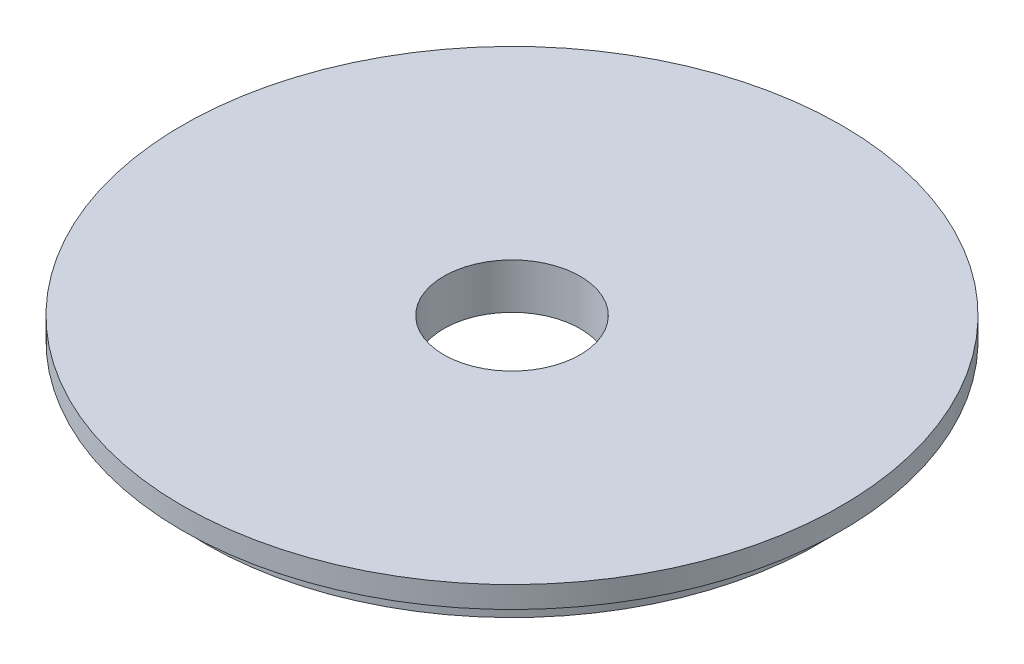
ISO-10303-21;
HEADER;
FILE_DESCRIPTION(('STEP AP214'),'2;1');
FILE_NAME('part.step','',(''),(''),'','','');
FILE_SCHEMA(('AUTOMOTIVE_DESIGN { 1 0 10303 214 1 1 1 1 }'));
ENDSEC;
DATA;
#1=APPLICATION_CONTEXT('core data for automotive mechanical design processes');
#2=APPLICATION_PROTOCOL_DEFINITION('international standard','automotive_design',2000,#1);
#3=PRODUCT_CONTEXT('',#1,'mechanical');
#4=PRODUCT('Part','Part','',(#3));
#5=PRODUCT_RELATED_PRODUCT_CATEGORY('part','',(#4));
#6=PRODUCT_DEFINITION_FORMATION('','',#4);
#7=PRODUCT_DEFINITION_CONTEXT('part definition',#1,'design');
#8=PRODUCT_DEFINITION('design','',#6,#7);
#9=PRODUCT_DEFINITION_SHAPE('','',#8);
#10=(LENGTH_UNIT() NAMED_UNIT(*) SI_UNIT(.MILLI.,.METRE.));
#11=(NAMED_UNIT(*) PLANE_ANGLE_UNIT() SI_UNIT($,.RADIAN.));
#12=(NAMED_UNIT(*) SI_UNIT($,.STERADIAN.) SOLID_ANGLE_UNIT());
#13=UNCERTAINTY_MEASURE_WITH_UNIT(LENGTH_MEASURE(1.E-05),#10,'distance_accuracy_value','');
#14=(GEOMETRIC_REPRESENTATION_CONTEXT(3) GLOBAL_UNCERTAINTY_ASSIGNED_CONTEXT((#13)) GLOBAL_UNIT_ASSIGNED_CONTEXT((#10,
#11,#12)) REPRESENTATION_CONTEXT('',''));
#15=CARTESIAN_POINT('',(0.,0.,0.));
#16=DIRECTION('',(0.,0.,1.));
#17=DIRECTION('',(1.,0.,0.));
#18=AXIS2_PLACEMENT_3D('',#15,#16,#17);
#19=CARTESIAN_POINT('',(0.,0.,0.));
#20=DIRECTION('',(0.,1.,0.));
#21=DIRECTION('',(0.,0.,1.));
#22=AXIS2_PLACEMENT_3D('',#19,#20,#21);
#23=CYLINDRICAL_SURFACE('',#22,9.525);
#24=CARTESIAN_POINT('',(0.,0.,0.));
#25=DIRECTION('',(0.,1.,0.));
#26=DIRECTION('',(0.,0.,1.));
#27=AXIS2_PLACEMENT_3D('',#24,#25,#26);
#28=CIRCLE('',#27,9.525);
#29=CARTESIAN_POINT('',(0.,0.,9.525));
#30=VERTEX_POINT('',#29);
#31=EDGE_CURVE('E10',#30,#30,#28,.T.);
#32=ORIENTED_EDGE('',*,*,#31,.T.);
#33=EDGE_LOOP('',(#32));
#34=FACE_BOUND('',#33,.T.);
#35=CARTESIAN_POINT('',(0.,-6.35,0.));
#36=DIRECTION('',(0.,1.,0.));
#37=DIRECTION('',(0.,0.,1.));
#38=AXIS2_PLACEMENT_3D('',#35,#36,#37);
#39=CIRCLE('',#38,9.525);
#40=CARTESIAN_POINT('',(0.,-6.35,9.525));
#41=VERTEX_POINT('',#40);
#42=EDGE_CURVE('E54',#41,#41,#39,.T.);
#43=ORIENTED_EDGE('',*,*,#42,.F.);
#44=EDGE_LOOP('',(#43));
#45=FACE_BOUND('',#44,.T.);
#46=ADVANCED_FACE('F32',(#34,#45),#23,.F.);
#47=CARTESIAN_POINT('',(-9.525,0.,0.));
#48=DIRECTION('',(0.,1.,0.));
#49=DIRECTION('',(0.,0.,1.));
#50=AXIS2_PLACEMENT_3D('',#47,#48,#49);
#51=PLANE('',#50);
#52=CARTESIAN_POINT('',(0.,0.,0.));
#53=DIRECTION('',(0.,1.,0.));
#54=DIRECTION('',(0.,0.,1.));
#55=AXIS2_PLACEMENT_3D('',#52,#53,#54);
#56=CIRCLE('',#55,46.0756);
#57=CARTESIAN_POINT('',(0.,0.,46.0756));
#58=VERTEX_POINT('',#57);
#59=EDGE_CURVE('E38',#58,#58,#56,.T.);
#60=ORIENTED_EDGE('',*,*,#59,.T.);
#61=EDGE_LOOP('',(#60));
#62=FACE_BOUND('',#61,.T.);
#63=ORIENTED_EDGE('',*,*,#31,.F.);
#64=EDGE_LOOP('',(#63));
#65=FACE_BOUND('',#64,.T.);
#66=ADVANCED_FACE('F62',(#62,#65),#51,.T.);
#67=CARTESIAN_POINT('',(0.,0.,0.));
#68=DIRECTION('',(0.,1.,0.));
#69=DIRECTION('',(0.,0.,1.));
#70=AXIS2_PLACEMENT_3D('',#67,#68,#69);
#71=CYLINDRICAL_SURFACE('',#70,46.0756);
#72=CARTESIAN_POINT('',(0.,-3.0226,0.));
#73=DIRECTION('',(0.,1.,0.));
#74=DIRECTION('',(0.,0.,1.));
#75=AXIS2_PLACEMENT_3D('',#72,#73,#74);
#76=CIRCLE('',#75,46.0756);
#77=CARTESIAN_POINT('',(0.,-3.0226,46.0756));
#78=VERTEX_POINT('',#77);
#79=EDGE_CURVE('E42',#78,#78,#76,.T.);
#80=ORIENTED_EDGE('',*,*,#79,.T.);
#81=EDGE_LOOP('',(#80));
#82=FACE_BOUND('',#81,.T.);
#83=ORIENTED_EDGE('',*,*,#59,.F.);
#84=EDGE_LOOP('',(#83));
#85=FACE_BOUND('',#84,.T.);
#86=ADVANCED_FACE('F66',(#82,#85),#71,.T.);
#87=CARTESIAN_POINT('',(-46.0756,-3.0226,0.));
#88=DIRECTION('',(0.,-1.,0.));
#89=DIRECTION('',(0.,0.,-1.));
#90=AXIS2_PLACEMENT_3D('',#87,#88,#89);
#91=PLANE('',#90);
#92=CARTESIAN_POINT('',(0.,-3.0226,0.));
#93=DIRECTION('',(0.,1.,0.));
#94=DIRECTION('',(0.,0.,1.));
#95=AXIS2_PLACEMENT_3D('',#92,#93,#94);
#96=CIRCLE('',#95,42.7482);
#97=CARTESIAN_POINT('',(0.,-3.0226,42.7482));
#98=VERTEX_POINT('',#97);
#99=EDGE_CURVE('E46',#98,#98,#96,.T.);
#100=ORIENTED_EDGE('',*,*,#99,.T.);
#101=EDGE_LOOP('',(#100));
#102=FACE_BOUND('',#101,.T.);
#103=ORIENTED_EDGE('',*,*,#79,.F.);
#104=EDGE_LOOP('',(#103));
#105=FACE_BOUND('',#104,.T.);
#106=ADVANCED_FACE('F70',(#102,#105),#91,.T.);
#107=CARTESIAN_POINT('',(0.,0.,0.));
#108=DIRECTION('',(0.,1.,0.));
#109=DIRECTION('',(0.,0.,1.));
#110=AXIS2_PLACEMENT_3D('',#107,#108,#109);
#111=CYLINDRICAL_SURFACE('',#110,42.7482);
#112=CARTESIAN_POINT('',(0.,-6.35,0.));
#113=DIRECTION('',(0.,1.,0.));
#114=DIRECTION('',(0.,0.,1.));
#115=AXIS2_PLACEMENT_3D('',#112,#113,#114);
#116=CIRCLE('',#115,42.7482);
#117=CARTESIAN_POINT('',(0.,-6.35,42.7482));
#118=VERTEX_POINT('',#117);
#119=EDGE_CURVE('E51',#118,#118,#116,.T.);
#120=ORIENTED_EDGE('',*,*,#119,.T.);
#121=EDGE_LOOP('',(#120));
#122=FACE_BOUND('',#121,.T.);
#123=ORIENTED_EDGE('',*,*,#99,.F.);
#124=EDGE_LOOP('',(#123));
#125=FACE_BOUND('',#124,.T.);
#126=ADVANCED_FACE('F77',(#122,#125),#111,.T.);
#127=CARTESIAN_POINT('',(-42.7482,-6.35,0.));
#128=DIRECTION('',(0.,-1.,0.));
#129=DIRECTION('',(0.,0.,-1.));
#130=AXIS2_PLACEMENT_3D('',#127,#128,#129);
#131=PLANE('',#130);
#132=ORIENTED_EDGE('',*,*,#42,.T.);
#133=EDGE_LOOP('',(#132));
#134=FACE_BOUND('',#133,.T.);
#135=ORIENTED_EDGE('',*,*,#119,.F.);
#136=EDGE_LOOP('',(#135));
#137=FACE_BOUND('',#136,.T.);
#138=ADVANCED_FACE('F58',(#134,#137),#131,.T.);
#139=CLOSED_SHELL('',(#46,#66,#86,#106,#126,#138));
#140=MANIFOLD_SOLID_BREP('B2',#139);
#141=ADVANCED_BREP_SHAPE_REPRESENTATION('',(#18,#140),#14);
#142=SHAPE_DEFINITION_REPRESENTATION(#9,#141);
ENDSEC;
END-ISO-10303-21;
